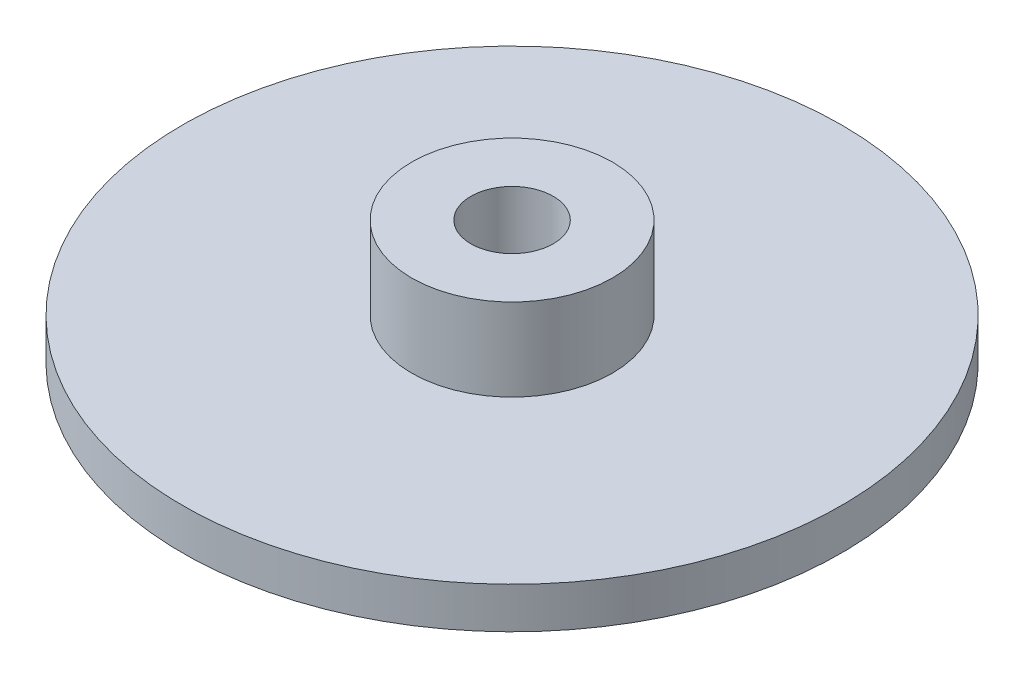
ISO-10303-21;
HEADER;
FILE_DESCRIPTION(('STEP AP214'),'2;1');
FILE_NAME('part.step','',(''),(''),'','','');
FILE_SCHEMA(('AUTOMOTIVE_DESIGN { 1 0 10303 214 1 1 1 1 }'));
ENDSEC;
DATA;
#1=APPLICATION_CONTEXT('core data for automotive mechanical design processes');
#2=APPLICATION_PROTOCOL_DEFINITION('international standard','automotive_design',2000,#1);
#3=PRODUCT_CONTEXT('',#1,'mechanical');
#4=PRODUCT('Part','Part','',(#3));
#5=PRODUCT_RELATED_PRODUCT_CATEGORY('part','',(#4));
#6=PRODUCT_DEFINITION_FORMATION('','',#4);
#7=PRODUCT_DEFINITION_CONTEXT('part definition',#1,'design');
#8=PRODUCT_DEFINITION('design','',#6,#7);
#9=PRODUCT_DEFINITION_SHAPE('','',#8);
#10=(LENGTH_UNIT() NAMED_UNIT(*) SI_UNIT(.MILLI.,.METRE.));
#11=(NAMED_UNIT(*) PLANE_ANGLE_UNIT() SI_UNIT($,.RADIAN.));
#12=(NAMED_UNIT(*) SI_UNIT($,.STERADIAN.) SOLID_ANGLE_UNIT());
#13=UNCERTAINTY_MEASURE_WITH_UNIT(LENGTH_MEASURE(1.E-05),#10,'distance_accuracy_value','');
#14=(GEOMETRIC_REPRESENTATION_CONTEXT(3) GLOBAL_UNCERTAINTY_ASSIGNED_CONTEXT((#13)) GLOBAL_UNIT_ASSIGNED_CONTEXT((#10,
#11,#12)) REPRESENTATION_CONTEXT('',''));
#15=CARTESIAN_POINT('',(0.,0.,0.));
#16=DIRECTION('',(0.,0.,1.));
#17=DIRECTION('',(1.,0.,0.));
#18=AXIS2_PLACEMENT_3D('',#15,#16,#17);
#19=CARTESIAN_POINT('',(0.,9.525,0.));
#20=DIRECTION('',(0.,-1.,0.));
#21=DIRECTION('',(0.,0.,-1.));
#22=AXIS2_PLACEMENT_3D('',#19,#20,#21);
#23=CYLINDRICAL_SURFACE('',#22,7.7390625);
#24=CARTESIAN_POINT('',(0.,3.175,0.));
#25=DIRECTION('',(0.,-1.,0.));
#26=DIRECTION('',(0.,0.,-1.));
#27=AXIS2_PLACEMENT_3D('',#24,#25,#26);
#28=CIRCLE('',#27,7.7390625);
#29=CARTESIAN_POINT('',(0.,3.175,-7.7390625));
#30=VERTEX_POINT('',#29);
#31=EDGE_CURVE('E34',#30,#30,#28,.T.);
#32=ORIENTED_EDGE('',*,*,#31,.F.);
#33=EDGE_LOOP('',(#32));
#34=FACE_BOUND('',#33,.T.);
#35=CARTESIAN_POINT('',(0.,9.525,0.));
#36=DIRECTION('',(0.,-1.,0.));
#37=DIRECTION('',(0.,0.,-1.));
#38=AXIS2_PLACEMENT_3D('',#35,#36,#37);
#39=CIRCLE('',#38,7.7390625);
#40=CARTESIAN_POINT('',(0.,9.525,-7.7390625));
#41=VERTEX_POINT('',#40);
#42=EDGE_CURVE('E18',#41,#41,#39,.F.);
#43=ORIENTED_EDGE('',*,*,#42,.F.);
#44=EDGE_LOOP('',(#43));
#45=FACE_BOUND('',#44,.T.);
#46=ADVANCED_FACE('F15',(#34,#45),#23,.T.);
#47=CARTESIAN_POINT('',(0.,9.525,0.));
#48=DIRECTION('',(0.,1.,0.));
#49=DIRECTION('',(0.,0.,1.));
#50=AXIS2_PLACEMENT_3D('',#47,#48,#49);
#51=PLANE('',#50);
#52=ORIENTED_EDGE('',*,*,#42,.T.);
#53=EDGE_LOOP('',(#52));
#54=FACE_BOUND('',#53,.T.);
#55=CARTESIAN_POINT('',(0.,9.525,0.));
#56=DIRECTION('',(0.,1.,0.));
#57=DIRECTION('',(0.,0.,1.));
#58=AXIS2_PLACEMENT_3D('',#55,#56,#57);
#59=CIRCLE('',#58,3.175);
#60=CARTESIAN_POINT('',(0.,9.525,3.175));
#61=VERTEX_POINT('',#60);
#62=EDGE_CURVE('E32',#61,#61,#59,.F.);
#63=ORIENTED_EDGE('',*,*,#62,.T.);
#64=EDGE_LOOP('',(#63));
#65=FACE_BOUND('',#64,.T.);
#66=ADVANCED_FACE('F41',(#54,#65),#51,.T.);
#67=CARTESIAN_POINT('',(0.,3.175,0.));
#68=DIRECTION('',(0.,1.,0.));
#69=DIRECTION('',(0.,0.,1.));
#70=AXIS2_PLACEMENT_3D('',#67,#68,#69);
#71=PLANE('',#70);
#72=ORIENTED_EDGE('',*,*,#31,.T.);
#73=EDGE_LOOP('',(#72));
#74=FACE_BOUND('',#73,.T.);
#75=CARTESIAN_POINT('',(0.,3.175,0.));
#76=DIRECTION('',(0.,-1.,0.));
#77=DIRECTION('',(0.,0.,-1.));
#78=AXIS2_PLACEMENT_3D('',#75,#76,#77);
#79=CIRCLE('',#78,25.4);
#80=CARTESIAN_POINT('',(0.,3.175,-25.4));
#81=VERTEX_POINT('',#80);
#82=EDGE_CURVE('E27',#81,#81,#79,.T.);
#83=ORIENTED_EDGE('',*,*,#82,.F.);
#84=EDGE_LOOP('',(#83));
#85=FACE_BOUND('',#84,.T.);
#86=ADVANCED_FACE('F50',(#74,#85),#71,.T.);
#87=CARTESIAN_POINT('',(0.,0.,0.));
#88=DIRECTION('',(0.,1.,0.));
#89=DIRECTION('',(0.,0.,1.));
#90=AXIS2_PLACEMENT_3D('',#87,#88,#89);
#91=CYLINDRICAL_SURFACE('',#90,3.175);
#92=CARTESIAN_POINT('',(0.,0.,0.));
#93=DIRECTION('',(0.,1.,0.));
#94=DIRECTION('',(0.,0.,1.));
#95=AXIS2_PLACEMENT_3D('',#92,#93,#94);
#96=CIRCLE('',#95,3.175);
#97=CARTESIAN_POINT('',(0.,0.,3.175));
#98=VERTEX_POINT('',#97);
#99=EDGE_CURVE('E22',#98,#98,#96,.F.);
#100=ORIENTED_EDGE('',*,*,#99,.T.);
#101=EDGE_LOOP('',(#100));
#102=FACE_BOUND('',#101,.T.);
#103=ORIENTED_EDGE('',*,*,#62,.F.);
#104=EDGE_LOOP('',(#103));
#105=FACE_BOUND('',#104,.T.);
#106=ADVANCED_FACE('F59',(#102,#105),#91,.F.);
#107=CARTESIAN_POINT('',(0.,3.175,0.));
#108=DIRECTION('',(0.,-1.,0.));
#109=DIRECTION('',(0.,0.,-1.));
#110=AXIS2_PLACEMENT_3D('',#107,#108,#109);
#111=CYLINDRICAL_SURFACE('',#110,25.4);
#112=ORIENTED_EDGE('',*,*,#82,.T.);
#113=EDGE_LOOP('',(#112));
#114=FACE_BOUND('',#113,.T.);
#115=CARTESIAN_POINT('',(0.,0.,0.));
#116=DIRECTION('',(0.,-1.,0.));
#117=DIRECTION('',(0.,0.,-1.));
#118=AXIS2_PLACEMENT_3D('',#115,#116,#117);
#119=CIRCLE('',#118,25.4);
#120=CARTESIAN_POINT('',(0.,0.,-25.4));
#121=VERTEX_POINT('',#120);
#122=EDGE_CURVE('E10',#121,#121,#119,.F.);
#123=ORIENTED_EDGE('',*,*,#122,.T.);
#124=EDGE_LOOP('',(#123));
#125=FACE_BOUND('',#124,.T.);
#126=ADVANCED_FACE('F53',(#114,#125),#111,.T.);
#127=CARTESIAN_POINT('',(0.,0.,0.));
#128=DIRECTION('',(0.,1.,0.));
#129=DIRECTION('',(0.,0.,1.));
#130=AXIS2_PLACEMENT_3D('',#127,#128,#129);
#131=PLANE('',#130);
#132=ORIENTED_EDGE('',*,*,#122,.F.);
#133=EDGE_LOOP('',(#132));
#134=FACE_BOUND('',#133,.T.);
#135=ORIENTED_EDGE('',*,*,#99,.F.);
#136=EDGE_LOOP('',(#135));
#137=FACE_BOUND('',#136,.T.);
#138=ADVANCED_FACE('F51',(#134,#137),#131,.F.);
#139=CLOSED_SHELL('',(#46,#66,#86,#106,#126,#138));
#140=MANIFOLD_SOLID_BREP('B1',#139);
#141=ADVANCED_BREP_SHAPE_REPRESENTATION('',(#18,#140),#14);
#142=SHAPE_DEFINITION_REPRESENTATION(#9,#141);
ENDSEC;
END-ISO-10303-21;
